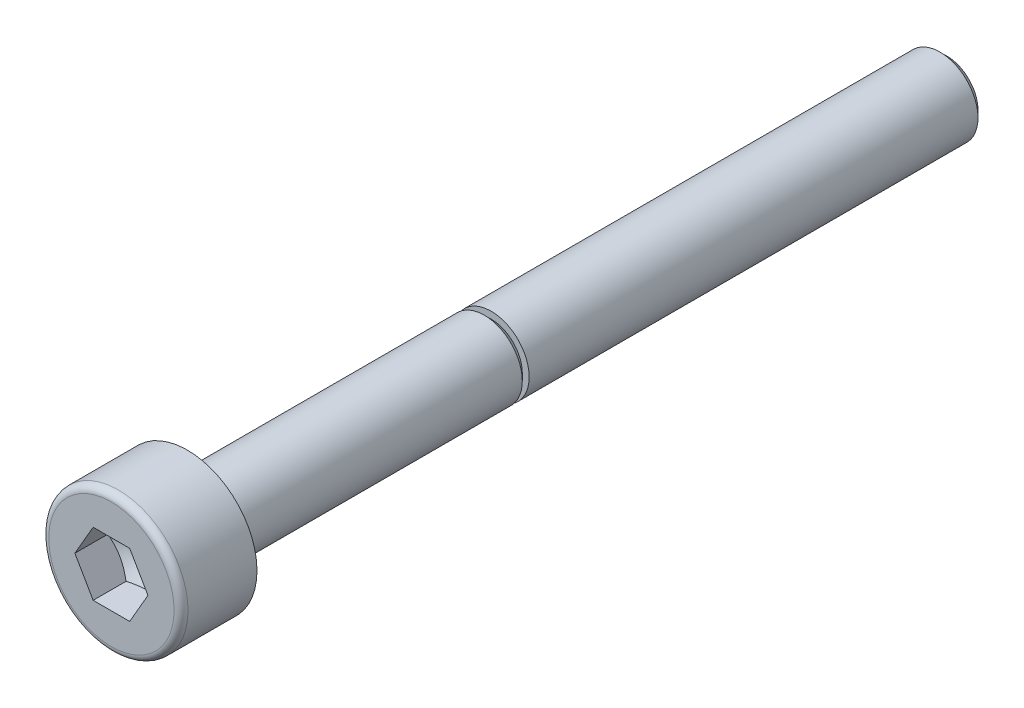
ISO-10303-21;
HEADER;
FILE_DESCRIPTION(('STEP AP214'),'2;1');
FILE_NAME('part.step','',(''),(''),'','','');
FILE_SCHEMA(('AUTOMOTIVE_DESIGN { 1 0 10303 214 1 1 1 1 }'));
ENDSEC;
DATA;
#1=APPLICATION_CONTEXT('core data for automotive mechanical design processes');
#2=APPLICATION_PROTOCOL_DEFINITION('international standard','automotive_design',2000,#1);
#3=PRODUCT_CONTEXT('',#1,'mechanical');
#4=PRODUCT('Part','Part','',(#3));
#5=PRODUCT_RELATED_PRODUCT_CATEGORY('part','',(#4));
#6=PRODUCT_DEFINITION_FORMATION('','',#4);
#7=PRODUCT_DEFINITION_CONTEXT('part definition',#1,'design');
#8=PRODUCT_DEFINITION('design','',#6,#7);
#9=PRODUCT_DEFINITION_SHAPE('','',#8);
#10=(LENGTH_UNIT() NAMED_UNIT(*) SI_UNIT(.MILLI.,.METRE.));
#11=(NAMED_UNIT(*) PLANE_ANGLE_UNIT() SI_UNIT($,.RADIAN.));
#12=(NAMED_UNIT(*) SI_UNIT($,.STERADIAN.) SOLID_ANGLE_UNIT());
#13=UNCERTAINTY_MEASURE_WITH_UNIT(LENGTH_MEASURE(1.E-05),#10,'distance_accuracy_value','');
#14=(GEOMETRIC_REPRESENTATION_CONTEXT(3) GLOBAL_UNCERTAINTY_ASSIGNED_CONTEXT((#13)) GLOBAL_UNIT_ASSIGNED_CONTEXT((#10,
#11,#12)) REPRESENTATION_CONTEXT('',''));
#15=CARTESIAN_POINT('',(0.,0.,0.));
#16=DIRECTION('',(0.,0.,1.));
#17=DIRECTION('',(1.,0.,0.));
#18=AXIS2_PLACEMENT_3D('',#15,#16,#17);
#19=CARTESIAN_POINT('',(0.,2.475,3.));
#20=DIRECTION('',(0.,0.,-1.));
#21=DIRECTION('',(-1.,0.,0.));
#22=AXIS2_PLACEMENT_3D('',#19,#20,#21);
#23=PLANE('',#22);
#24=CARTESIAN_POINT('',(0.,0.,3.));
#25=DIRECTION('',(0.,0.,1.));
#26=DIRECTION('',(1.,0.,0.));
#27=AXIS2_PLACEMENT_3D('',#24,#25,#26);
#28=CIRCLE('',#27,2.475);
#29=CARTESIAN_POINT('',(2.475,0.,3.));
#30=VERTEX_POINT('',#29);
#31=EDGE_CURVE('E136',#30,#30,#28,.T.);
#32=ORIENTED_EDGE('',*,*,#31,.T.);
#33=EDGE_LOOP('',(#32));
#34=FACE_BOUND('',#33,.T.);
#35=DIRECTION('',(0.5,-0.866025403784439,0.));
#36=VECTOR('',#35,1.);
#37=CARTESIAN_POINT('',(0.7216875,1.24999941718736,3.));
#38=LINE('',#37,#36);
#39=CARTESIAN_POINT('',(0.7216875,1.24999941718736,3.));
#40=VERTEX_POINT('',#39);
#41=CARTESIAN_POINT('',(1.443375,0.,3.));
#42=VERTEX_POINT('',#41);
#43=EDGE_CURVE('E30',#40,#42,#38,.T.);
#44=ORIENTED_EDGE('',*,*,#43,.T.);
#45=DIRECTION('',(-0.5,-0.866025403784439,0.));
#46=VECTOR('',#45,1.);
#47=CARTESIAN_POINT('',(1.443375,0.,3.));
#48=LINE('',#47,#46);
#49=CARTESIAN_POINT('',(0.7216875,-1.24999941718736,3.));
#50=VERTEX_POINT('',#49);
#51=EDGE_CURVE('E183',#42,#50,#48,.T.);
#52=ORIENTED_EDGE('',*,*,#51,.T.);
#53=DIRECTION('',(-1.,0.,0.));
#54=VECTOR('',#53,1.);
#55=CARTESIAN_POINT('',(0.7216875,-1.24999941718736,3.));
#56=LINE('',#55,#54);
#57=CARTESIAN_POINT('',(-0.7216875,-1.24999941718736,3.));
#58=VERTEX_POINT('',#57);
#59=EDGE_CURVE('E188',#50,#58,#56,.T.);
#60=ORIENTED_EDGE('',*,*,#59,.T.);
#61=DIRECTION('',(-0.5,0.866025403784439,0.));
#62=VECTOR('',#61,1.);
#63=CARTESIAN_POINT('',(-0.7216875,-1.24999941718736,3.));
#64=LINE('',#63,#62);
#65=CARTESIAN_POINT('',(-1.443375,0.,3.));
#66=VERTEX_POINT('',#65);
#67=EDGE_CURVE('E192',#58,#66,#64,.T.);
#68=ORIENTED_EDGE('',*,*,#67,.T.);
#69=DIRECTION('',(0.5,0.866025403784439,0.));
#70=VECTOR('',#69,1.);
#71=CARTESIAN_POINT('',(-1.443375,0.,3.));
#72=LINE('',#71,#70);
#73=CARTESIAN_POINT('',(-0.7216875,1.24999941718736,3.));
#74=VERTEX_POINT('',#73);
#75=EDGE_CURVE('E102',#66,#74,#72,.T.);
#76=ORIENTED_EDGE('',*,*,#75,.T.);
#77=DIRECTION('',(1.,0.,0.));
#78=VECTOR('',#77,1.);
#79=CARTESIAN_POINT('',(-0.7216875,1.24999941718736,3.));
#80=LINE('',#79,#78);
#81=EDGE_CURVE('E93',#74,#40,#80,.T.);
#82=ORIENTED_EDGE('',*,*,#81,.T.);
#83=EDGE_LOOP('',(#44,#52,#60,#68,#76,#82));
#84=FACE_BOUND('',#83,.T.);
#85=ADVANCED_FACE('F15',(#34,#84),#23,.F.);
#86=CARTESIAN_POINT('',(0.,0.,0.));
#87=DIRECTION('',(0.,0.,1.));
#88=DIRECTION('',(1.,0.,0.));
#89=AXIS2_PLACEMENT_3D('',#86,#87,#88);
#90=PLANE('',#89);
#91=CARTESIAN_POINT('',(0.,0.,0.));
#92=DIRECTION('',(0.,0.,1.));
#93=DIRECTION('',(1.,0.,0.));
#94=AXIS2_PLACEMENT_3D('',#91,#92,#93);
#95=CIRCLE('',#94,2.75);
#96=CARTESIAN_POINT('',(2.75,0.,0.));
#97=VERTEX_POINT('',#96);
#98=EDGE_CURVE('E23',#97,#97,#95,.T.);
#99=ORIENTED_EDGE('',*,*,#98,.F.);
#100=EDGE_LOOP('',(#99));
#101=FACE_BOUND('',#100,.T.);
#102=CARTESIAN_POINT('',(0.,0.,0.));
#103=DIRECTION('',(0.,0.,1.));
#104=DIRECTION('',(1.,0.,0.));
#105=AXIS2_PLACEMENT_3D('',#102,#103,#104);
#106=CIRCLE('',#105,1.5);
#107=CARTESIAN_POINT('',(1.5,0.,0.));
#108=VERTEX_POINT('',#107);
#109=EDGE_CURVE('E9',#108,#108,#106,.F.);
#110=ORIENTED_EDGE('',*,*,#109,.F.);
#111=EDGE_LOOP('',(#110));
#112=FACE_BOUND('',#111,.T.);
#113=ADVANCED_FACE('F151',(#101,#112),#90,.F.);
#114=CARTESIAN_POINT('',(0.,0.,3.));
#115=DIRECTION('',(0.,0.,1.));
#116=DIRECTION('',(1.,0.,0.));
#117=AXIS2_PLACEMENT_3D('',#114,#115,#116);
#118=CYLINDRICAL_SURFACE('',#117,2.75);
#119=CARTESIAN_POINT('',(0.,0.,2.725));
#120=DIRECTION('',(0.,0.,1.));
#121=DIRECTION('',(1.,0.,0.));
#122=AXIS2_PLACEMENT_3D('',#119,#120,#121);
#123=CIRCLE('',#122,2.75);
#124=CARTESIAN_POINT('',(2.75,0.,2.725));
#125=VERTEX_POINT('',#124);
#126=EDGE_CURVE('E140',#125,#125,#123,.T.);
#127=ORIENTED_EDGE('',*,*,#126,.F.);
#128=EDGE_LOOP('',(#127));
#129=FACE_BOUND('',#128,.T.);
#130=ORIENTED_EDGE('',*,*,#98,.T.);
#131=EDGE_LOOP('',(#130));
#132=FACE_BOUND('',#131,.T.);
#133=ADVANCED_FACE('F149',(#129,#132),#118,.T.);
#134=CARTESIAN_POINT('',(0.,0.,2.725));
#135=DIRECTION('',(0.,0.,1.));
#136=DIRECTION('',(1.,0.,0.));
#137=AXIS2_PLACEMENT_3D('',#134,#135,#136);
#138=TOROIDAL_SURFACE('',#137,2.475,0.275);
#139=ORIENTED_EDGE('',*,*,#31,.F.);
#140=EDGE_LOOP('',(#139));
#141=FACE_BOUND('',#140,.T.);
#142=ORIENTED_EDGE('',*,*,#126,.T.);
#143=EDGE_LOOP('',(#142));
#144=FACE_BOUND('',#143,.T.);
#145=ADVANCED_FACE('F159',(#141,#144),#138,.T.);
#146=CARTESIAN_POINT('',(0.,0.,0.));
#147=DIRECTION('',(0.,0.,1.));
#148=DIRECTION('',(1.,0.,0.));
#149=AXIS2_PLACEMENT_3D('',#146,#147,#148);
#150=CYLINDRICAL_SURFACE('',#149,1.5);
#151=CARTESIAN_POINT('',(0.,0.,-11.729375));
#152=DIRECTION('',(0.,0.,1.));
#153=DIRECTION('',(1.,0.,0.));
#154=AXIS2_PLACEMENT_3D('',#151,#152,#153);
#155=CIRCLE('',#154,1.5);
#156=CARTESIAN_POINT('',(1.5,0.,-11.729375));
#157=VERTEX_POINT('',#156);
#158=EDGE_CURVE('E116',#157,#157,#155,.T.);
#159=ORIENTED_EDGE('',*,*,#158,.T.);
#160=EDGE_LOOP('',(#159));
#161=FACE_BOUND('',#160,.T.);
#162=ORIENTED_EDGE('',*,*,#109,.T.);
#163=EDGE_LOOP('',(#162));
#164=FACE_BOUND('',#163,.T.);
#165=ADVANCED_FACE('F156',(#161,#164),#150,.T.);
#166=CARTESIAN_POINT('',(0.,0.,-30.));
#167=DIRECTION('',(0.,0.,1.));
#168=DIRECTION('',(1.,0.,0.));
#169=AXIS2_PLACEMENT_3D('',#166,#167,#168);
#170=PLANE('',#169);
#171=CARTESIAN_POINT('',(0.,0.,-30.));
#172=DIRECTION('',(0.,0.,1.));
#173=DIRECTION('',(1.,0.,0.));
#174=AXIS2_PLACEMENT_3D('',#171,#172,#173);
#175=CIRCLE('',#174,1.229375);
#176=CARTESIAN_POINT('',(1.229375,0.,-30.));
#177=VERTEX_POINT('',#176);
#178=EDGE_CURVE('E132',#177,#177,#175,.T.);
#179=ORIENTED_EDGE('',*,*,#178,.F.);
#180=EDGE_LOOP('',(#179));
#181=FACE_BOUND('',#180,.T.);
#182=ADVANCED_FACE('F158',(#181),#170,.F.);
#183=CARTESIAN_POINT('',(0.,0.,-30.));
#184=DIRECTION('',(0.,0.,1.));
#185=DIRECTION('',(1.,0.,0.));
#186=AXIS2_PLACEMENT_3D('',#183,#184,#185);
#187=CONICAL_SURFACE('',#186,1.229375,0.785398163397457);
#188=CARTESIAN_POINT('',(0.,0.,-29.729375));
#189=DIRECTION('',(0.,0.,1.));
#190=DIRECTION('',(1.,0.,0.));
#191=AXIS2_PLACEMENT_3D('',#188,#189,#190);
#192=CIRCLE('',#191,1.5);
#193=CARTESIAN_POINT('',(1.5,0.,-29.729375));
#194=VERTEX_POINT('',#193);
#195=EDGE_CURVE('E128',#194,#194,#192,.T.);
#196=ORIENTED_EDGE('',*,*,#195,.F.);
#197=EDGE_LOOP('',(#196));
#198=FACE_BOUND('',#197,.T.);
#199=ORIENTED_EDGE('',*,*,#178,.T.);
#200=EDGE_LOOP('',(#199));
#201=FACE_BOUND('',#200,.T.);
#202=ADVANCED_FACE('F167',(#198,#201),#187,.T.);
#203=CARTESIAN_POINT('',(0.,0.,0.));
#204=DIRECTION('',(0.,0.,1.));
#205=DIRECTION('',(1.,0.,0.));
#206=AXIS2_PLACEMENT_3D('',#203,#204,#205);
#207=CYLINDRICAL_SURFACE('',#206,1.5);
#208=CARTESIAN_POINT('',(0.,0.,-12.));
#209=DIRECTION('',(0.,0.,1.));
#210=DIRECTION('',(1.,0.,0.));
#211=AXIS2_PLACEMENT_3D('',#208,#209,#210);
#212=CIRCLE('',#211,1.5);
#213=CARTESIAN_POINT('',(1.5,0.,-12.));
#214=VERTEX_POINT('',#213);
#215=EDGE_CURVE('E124',#214,#214,#212,.T.);
#216=ORIENTED_EDGE('',*,*,#215,.F.);
#217=EDGE_LOOP('',(#216));
#218=FACE_BOUND('',#217,.T.);
#219=ORIENTED_EDGE('',*,*,#195,.T.);
#220=EDGE_LOOP('',(#219));
#221=FACE_BOUND('',#220,.T.);
#222=ADVANCED_FACE('F328',(#218,#221),#207,.T.);
#223=CARTESIAN_POINT('',(0.,1.5,-12.));
#224=DIRECTION('',(0.,0.,-1.));
#225=DIRECTION('',(-1.,0.,0.));
#226=AXIS2_PLACEMENT_3D('',#223,#224,#225);
#227=PLANE('',#226);
#228=CARTESIAN_POINT('',(0.,0.,-12.));
#229=DIRECTION('',(0.,0.,1.));
#230=DIRECTION('',(1.,0.,0.));
#231=AXIS2_PLACEMENT_3D('',#228,#229,#230);
#232=CIRCLE('',#231,1.229375);
#233=CARTESIAN_POINT('',(1.229375,0.,-12.));
#234=VERTEX_POINT('',#233);
#235=EDGE_CURVE('E120',#234,#234,#232,.T.);
#236=ORIENTED_EDGE('',*,*,#235,.F.);
#237=EDGE_LOOP('',(#236));
#238=FACE_BOUND('',#237,.T.);
#239=ORIENTED_EDGE('',*,*,#215,.T.);
#240=EDGE_LOOP('',(#239));
#241=FACE_BOUND('',#240,.T.);
#242=ADVANCED_FACE('F320',(#238,#241),#227,.F.);
#243=CARTESIAN_POINT('',(0.,0.,-12.));
#244=DIRECTION('',(0.,0.,1.));
#245=DIRECTION('',(1.,0.,0.));
#246=AXIS2_PLACEMENT_3D('',#243,#244,#245);
#247=CONICAL_SURFACE('',#246,1.229375,0.785398163397449);
#248=ORIENTED_EDGE('',*,*,#158,.F.);
#249=EDGE_LOOP('',(#248));
#250=FACE_BOUND('',#249,.T.);
#251=ORIENTED_EDGE('',*,*,#235,.T.);
#252=EDGE_LOOP('',(#251));
#253=FACE_BOUND('',#252,.T.);
#254=ADVANCED_FACE('F313',(#250,#253),#247,.T.);
#255=CARTESIAN_POINT('',(0.7216875,1.24999941718736,0.866667055208424));
#256=DIRECTION('',(-0.866025403784439,-0.5,0.));
#257=DIRECTION('',(-0.5,0.866025403784439,0.));
#258=AXIS2_PLACEMENT_3D('',#255,#256,#257);
#259=PLANE('',#258);
#260=DIRECTION('',(0.,0.,1.));
#261=VECTOR('',#260,1.);
#262=CARTESIAN_POINT('',(1.443375,0.,0.866667055208424));
#263=LINE('',#262,#261);
#264=CARTESIAN_POINT('',(1.443375,0.,1.7));
#265=VERTEX_POINT('',#264);
#266=EDGE_CURVE('E114',#265,#42,#263,.T.);
#267=ORIENTED_EDGE('',*,*,#266,.T.);
#268=ORIENTED_EDGE('',*,*,#43,.F.);
#269=DIRECTION('',(0.,0.,1.));
#270=VECTOR('',#269,1.);
#271=CARTESIAN_POINT('',(0.7216875,1.24999941718736,0.866667055208424));
#272=LINE('',#271,#270);
#273=CARTESIAN_POINT('',(0.7216875,1.24999941718736,1.7));
#274=VERTEX_POINT('',#273);
#275=EDGE_CURVE('E86',#274,#40,#272,.T.);
#276=ORIENTED_EDGE('',*,*,#275,.F.);
#277=CARTESIAN_POINT('',(1.44337615470054,-2.E-06,1.70000066666746));
#278=CARTESIAN_POINT('',(1.41166234028678,0.0549279378664336,1.68168533615401));
#279=CARTESIAN_POINT('',(1.37967477272109,0.110332030100754,1.665028493242));
#280=CARTESIAN_POINT('',(1.31514579266581,0.222099502117096,1.63595445502155));
#281=CARTESIAN_POINT('',(1.28260323398259,0.278464867164723,1.62354754391631));
#282=CARTESIAN_POINT('',(1.2179214008177,0.39049708853301,1.60423526604097));
#283=CARTESIAN_POINT('',(1.18579207575664,0.446146711951657,1.59720135081684));
#284=CARTESIAN_POINT('',(1.12138232312734,0.557707676008561,1.58880584887112));
#285=CARTESIAN_POINT('',(1.08910212951503,0.613618611423235,1.5874373083282));
#286=CARTESIAN_POINT('',(1.02878989848834,0.718082459879303,1.59029140151107));
#287=CARTESIAN_POINT('',(1.00074881136366,0.766651047478699,1.59381326069777));
#288=CARTESIAN_POINT('',(0.94484931590916,0.863471813723365,1.60497329524828));
#289=CARTESIAN_POINT('',(0.916991100780736,0.91172365773398,1.61261527923588));
#290=CARTESIAN_POINT('',(0.860976444321451,1.00874388868998,1.63171878575366));
#291=CARTESIAN_POINT('',(0.832827088932361,1.0575000024242,1.64326125012845));
#292=CARTESIAN_POINT('',(0.776948107685497,1.15428523701895,1.6694577743606));
#293=CARTESIAN_POINT('',(0.749217766489108,1.20231559688232,1.68410568290989));
#294=CARTESIAN_POINT('',(0.721686345299461,1.25000141718736,1.70000066666746));
#295=B_SPLINE_CURVE_WITH_KNOTS('',3,(#277,#278,#279,#280,#281,#282,#283,#284,#285,#286,#287,
#288,#289,#290,#291,#292,#293,#294),.UNSPECIFIED.,.F.,.F.,(4,2,2,2,2,2,2,2,4),(0.,
0.198135072963001,0.396746271230005,0.590442442133857,0.783900794935013,0.952318546997791,
1.12089225123217,1.29320414395206,1.46517785562982),.UNSPECIFIED.);
#296=EDGE_CURVE('E78',#265,#274,#295,.T.);
#297=ORIENTED_EDGE('',*,*,#296,.F.);
#298=EDGE_LOOP('',(#267,#268,#276,#297));
#299=FACE_BOUND('',#298,.T.);
#300=ADVANCED_FACE('F87',(#299),#259,.T.);
#301=CARTESIAN_POINT('',(1.443375,0.,0.866667055208424));
#302=DIRECTION('',(-0.866025403784439,0.5,0.));
#303=DIRECTION('',(0.5,0.866025403784439,0.));
#304=AXIS2_PLACEMENT_3D('',#301,#302,#303);
#305=PLANE('',#304);
#306=DIRECTION('',(0.,0.,1.));
#307=VECTOR('',#306,1.);
#308=CARTESIAN_POINT('',(0.7216875,-1.24999941718736,0.866667055208424));
#309=LINE('',#308,#307);
#310=CARTESIAN_POINT('',(0.7216875,-1.24999941718736,1.7));
#311=VERTEX_POINT('',#310);
#312=EDGE_CURVE('E111',#311,#50,#309,.T.);
#313=ORIENTED_EDGE('',*,*,#312,.T.);
#314=ORIENTED_EDGE('',*,*,#51,.F.);
#315=ORIENTED_EDGE('',*,*,#266,.F.);
#316=CARTESIAN_POINT('',(0.721686345299462,-1.25000141718736,1.70000066666746));
#317=CARTESIAN_POINT('',(0.753400159713217,-1.19507147932093,1.68168533615401));
#318=CARTESIAN_POINT('',(0.785387727278908,-1.13966738708661,1.665028493242));
#319=CARTESIAN_POINT('',(0.849916707334187,-1.02789991507027,1.63595445502155));
#320=CARTESIAN_POINT('',(0.882459266017406,-0.971534550022641,1.62354754391631));
#321=CARTESIAN_POINT('',(0.947141099182298,-0.859502328654354,1.60423526604097));
#322=CARTESIAN_POINT('',(0.979270424243356,-0.803852705235707,1.59720135081684));
#323=CARTESIAN_POINT('',(1.04368017687266,-0.692291741178803,1.58880584887112));
#324=CARTESIAN_POINT('',(1.07596037048497,-0.63638080576413,1.5874373083282));
#325=CARTESIAN_POINT('',(1.13627260151166,-0.531916957308062,1.59029140151107));
#326=CARTESIAN_POINT('',(1.16431368863634,-0.483348369708666,1.59381326069777));
#327=CARTESIAN_POINT('',(1.22021318409084,-0.386527603463999,1.60497329524828));
#328=CARTESIAN_POINT('',(1.24807139921926,-0.338275759453385,1.61261527923588));
#329=CARTESIAN_POINT('',(1.30408605567855,-0.241255528497386,1.63171878575366));
#330=CARTESIAN_POINT('',(1.33223541106764,-0.192499414763169,1.64326125012845));
#331=CARTESIAN_POINT('',(1.3881143923145,-0.0957141801684128,1.6694577743606));
#332=CARTESIAN_POINT('',(1.41584473351089,-0.0476838203050465,1.68410568290989));
#333=CARTESIAN_POINT('',(1.44337615470054,1.99999999983435E-06,1.70000066666746));
#334=B_SPLINE_CURVE_WITH_KNOTS('',3,(#316,#317,#318,#319,#320,#321,#322,#323,#324,#325,#326,
#327,#328,#329,#330,#331,#332,#333),.UNSPECIFIED.,.F.,.F.,(4,2,2,2,2,2,2,2,4),(0.,
0.198135072963001,0.396746271230005,0.590442442133857,0.783900794935012,0.95231854699779,
1.12089225123217,1.29320414395206,1.46517785562982),.UNSPECIFIED.);
#335=EDGE_CURVE('E82',#311,#265,#334,.T.);
#336=ORIENTED_EDGE('',*,*,#335,.F.);
#337=EDGE_LOOP('',(#313,#314,#315,#336));
#338=FACE_BOUND('',#337,.T.);
#339=ADVANCED_FACE('F248',(#338),#305,.T.);
#340=CARTESIAN_POINT('',(0.7216875,-1.24999941718736,0.866667055208424));
#341=DIRECTION('',(0.,1.,0.));
#342=DIRECTION('',(1.,0.,0.));
#343=AXIS2_PLACEMENT_3D('',#340,#341,#342);
#344=PLANE('',#343);
#345=DIRECTION('',(0.,0.,1.));
#346=VECTOR('',#345,1.);
#347=CARTESIAN_POINT('',(-0.7216875,-1.24999941718736,0.866667055208424));
#348=LINE('',#347,#346);
#349=CARTESIAN_POINT('',(-0.7216875,-1.24999941718736,1.7));
#350=VERTEX_POINT('',#349);
#351=EDGE_CURVE('E108',#350,#58,#348,.T.);
#352=ORIENTED_EDGE('',*,*,#351,.T.);
#353=ORIENTED_EDGE('',*,*,#59,.F.);
#354=ORIENTED_EDGE('',*,*,#312,.F.);
#355=CARTESIAN_POINT('',(-1.86893053107489,-1.24999941718736,2.16479389453662));
#356=CARTESIAN_POINT('',(-1.81495117776836,-1.24999941718736,2.13889663446086));
#357=CARTESIAN_POINT('',(-1.76084043441986,-1.24999941718736,2.11326843017583));
#358=CARTESIAN_POINT('',(-1.65228585942289,-1.24999941718736,2.06270259301794));
#359=CARTESIAN_POINT('',(-1.59784196995446,-1.24999941718736,2.03776508442438));
#360=CARTESIAN_POINT('',(-1.48823862830604,-1.24999941718736,1.98859378412848));
#361=CARTESIAN_POINT('',(-1.43307683885742,-1.24999941718736,1.964365178818));
#362=CARTESIAN_POINT('',(-1.32229127521218,-1.24999941718736,1.91699497239768));
#363=CARTESIAN_POINT('',(-1.26666752521415,-1.24999941718736,1.89385331476833));
#364=CARTESIAN_POINT('',(-1.15340030068293,-1.24999941718736,1.84835454701775));
#365=CARTESIAN_POINT('',(-1.09574203904477,-1.24999941718736,1.82603375946839));
#366=CARTESIAN_POINT('',(-0.979740631963517,-1.24999941718736,1.7832554401815));
#367=CARTESIAN_POINT('',(-0.921397401730977,-1.24999941718736,1.76279814192238));
#368=CARTESIAN_POINT('',(-0.745435180245369,-1.24999941718736,1.7050842361654));
#369=CARTESIAN_POINT('',(-0.626561647576072,-1.24999941718736,1.6713502286798));
#370=CARTESIAN_POINT('',(-0.445872875814715,-1.24999941718736,1.63222043843359));
#371=CARTESIAN_POINT('',(-0.385304520505474,-1.24999941718736,1.62109409740059));
#372=CARTESIAN_POINT('',(-0.263486469039549,-1.24999941718736,1.60342789727153));
#373=CARTESIAN_POINT('',(-0.20223681921018,-1.24999941718736,1.59688772823406));
#374=CARTESIAN_POINT('',(-0.0801324091719259,-1.24999941718736,1.58899883278388));
#375=CARTESIAN_POINT('',(-0.0192817104364654,-1.24999941718736,1.58758884366631));
#376=CARTESIAN_POINT('',(0.102319185361569,-1.24999941718736,1.58991623923036));
#377=CARTESIAN_POINT('',(0.163069375967905,-1.24999941718736,1.59365394263641));
#378=CARTESIAN_POINT('',(0.312961455362286,-1.24999941718736,1.60889807076613));
#379=CARTESIAN_POINT('',(0.40181287263432,-1.24999941718736,1.62326128492051));
#380=CARTESIAN_POINT('',(0.577787885436386,-1.24999941718736,1.66029986996745));
#381=CARTESIAN_POINT('',(0.664909264565296,-1.24999941718736,1.6829852590032));
#382=CARTESIAN_POINT('',(0.795208864990653,-1.24999941718736,1.72173744658089));
#383=CARTESIAN_POINT('',(0.839060620655932,-1.24999941718736,1.73562293145017));
#384=CARTESIAN_POINT('',(0.926307663712636,-1.24999941718736,1.76467838801274));
#385=CARTESIAN_POINT('',(0.969703217226752,-1.24999941718736,1.77984755808705));
#386=CARTESIAN_POINT('',(1.05609584795378,-1.24999941718736,1.81125008410185));
#387=CARTESIAN_POINT('',(1.09909299597128,-1.24999941718736,1.82748324664252));
#388=CARTESIAN_POINT('',(1.18474848915208,-1.24999941718736,1.86083816989018));
#389=CARTESIAN_POINT('',(1.22740677566046,-1.24999941718736,1.87796008072948));
#390=CARTESIAN_POINT('',(1.33629337906013,-1.24999941718736,1.92276108125511));
#391=CARTESIAN_POINT('',(1.40230397627437,-1.24999941718736,1.95096876212353));
#392=CARTESIAN_POINT('',(1.53372907463052,-1.24999941718736,2.00874389121968));
#393=CARTESIAN_POINT('',(1.59914353067598,-1.24999941718736,2.03831144131143));
#394=CARTESIAN_POINT('',(1.79469131828896,-1.24999941718736,2.12857452862346));
#395=CARTESIAN_POINT('',(1.92410722703437,-1.24999941718736,2.19082124932175));
#396=CARTESIAN_POINT('',(2.18183340208154,-1.24999941718736,2.31792530727724));
#397=CARTESIAN_POINT('',(2.31014211360569,-1.24999941718736,2.3827857597699));
#398=CARTESIAN_POINT('',(2.565880437641,-1.24999941718736,2.51417443954414));
#399=CARTESIAN_POINT('',(2.69331015929244,-1.24999941718736,2.58070245483918));
#400=CARTESIAN_POINT('',(2.93556233058972,-1.24999941718736,2.70857379582091));
#401=CARTESIAN_POINT('',(3.05043950275986,-1.24999941718736,2.76981380943349));
#402=CARTESIAN_POINT('',(3.27982431975772,-1.24999941718736,2.89299160700423));
#403=CARTESIAN_POINT('',(3.39433195070739,-1.24999941718736,2.95492941678458));
#404=CARTESIAN_POINT('',(3.62277162051502,-1.24999941718736,3.07916961449806));
#405=CARTESIAN_POINT('',(3.73670438259663,-1.24999941718736,3.14147067442078));
#406=CARTESIAN_POINT('',(3.96433956104116,-1.24999941718736,3.26647828608533));
#407=CARTESIAN_POINT('',(4.07804198914647,-1.24999941718736,3.32918481643642));
#408=CARTESIAN_POINT('',(4.19166166337244,-1.24999941718736,3.39204003381013));
#409=B_SPLINE_CURVE_WITH_KNOTS('',3,(#355,#356,#357,#358,#359,#360,#361,#362,#363,#364,#365,
#366,#367,#368,#369,#370,#371,#372,#373,#374,#375,#376,#377,#378,#379,#380,#381,#382,#383,#384,
#385,#386,#387,#388,#389,#390,#391,#392,#393,#394,#395,#396,#397,#398,#399,#400,#401,#402,#403,
#404,#405,#406,#407,#408),.UNSPECIFIED.,.F.,.F.,(4,2,2,2,2,2,2,2,2,2,2,2,2,2,2,2,2,2,2,2,2,2,2,
2,2,2,4),(0.,0.179612840817485,0.359257792773138,0.539992477393523,0.72071775367729,
0.906167353114828,1.09164015584897,1.46153946542598,1.64614477745769,1.83073761234132,
2.01311873652213,2.1955111535168,2.46497183475509,2.73475795996105,2.87273569413166,
3.01062789275234,3.14849509611698,3.28638566505407,3.50171816734966,3.71706682595868,
4.14783526963883,4.57913326931211,5.01037671616215,5.40091711572386,5.79147201515411,
6.18103353481212,6.57057466801426),.UNSPECIFIED.);
#410=EDGE_CURVE('E236',#350,#311,#409,.T.);
#411=ORIENTED_EDGE('',*,*,#410,.F.);
#412=EDGE_LOOP('',(#352,#353,#354,#411));
#413=FACE_BOUND('',#412,.T.);
#414=ADVANCED_FACE('F243',(#413),#344,.T.);
#415=CARTESIAN_POINT('',(-0.7216875,-1.24999941718736,0.866667055208424));
#416=DIRECTION('',(0.866025403784439,0.5,0.));
#417=DIRECTION('',(0.5,-0.866025403784439,0.));
#418=AXIS2_PLACEMENT_3D('',#415,#416,#417);
#419=PLANE('',#418);
#420=DIRECTION('',(0.,0.,1.));
#421=VECTOR('',#420,1.);
#422=CARTESIAN_POINT('',(-1.443375,0.,0.866667055208424));
#423=LINE('',#422,#421);
#424=CARTESIAN_POINT('',(-1.443375,0.,1.7));
#425=VERTEX_POINT('',#424);
#426=EDGE_CURVE('E99',#425,#66,#423,.T.);
#427=ORIENTED_EDGE('',*,*,#426,.T.);
#428=ORIENTED_EDGE('',*,*,#67,.F.);
#429=ORIENTED_EDGE('',*,*,#351,.F.);
#430=CARTESIAN_POINT('',(-1.44337615470054,2.00000000041633E-06,1.70000066666746));
#431=CARTESIAN_POINT('',(-1.41166234028678,-0.0549279378664328,1.68168533615401));
#432=CARTESIAN_POINT('',(-1.37967477272109,-0.110332030100753,1.665028493242));
#433=CARTESIAN_POINT('',(-1.31514579266581,-0.222099502117095,1.63595445502155));
#434=CARTESIAN_POINT('',(-1.28260323398259,-0.278464867164722,1.62354754391631));
#435=CARTESIAN_POINT('',(-1.2179214008177,-0.390497088533009,1.60423526604097));
#436=CARTESIAN_POINT('',(-1.18579207575664,-0.446146711951656,1.59720135081684));
#437=CARTESIAN_POINT('',(-1.12138232312734,-0.55770767600856,1.58880584887112));
#438=CARTESIAN_POINT('',(-1.08910212951503,-0.613618611423234,1.5874373083282));
#439=CARTESIAN_POINT('',(-1.02878989848834,-0.718082459879302,1.59029140151107));
#440=CARTESIAN_POINT('',(-1.00074881136366,-0.766651047478698,1.59381326069777));
#441=CARTESIAN_POINT('',(-0.944849315909161,-0.863471813723365,1.60497329524827));
#442=CARTESIAN_POINT('',(-0.916991100780737,-0.911723657733979,1.61261527923588));
#443=CARTESIAN_POINT('',(-0.860976444321451,-1.00874388868998,1.63171878575366));
#444=CARTESIAN_POINT('',(-0.832827088932361,-1.0575000024242,1.64326125012845));
#445=CARTESIAN_POINT('',(-0.776948107685497,-1.15428523701895,1.6694577743606));
#446=CARTESIAN_POINT('',(-0.749217766489108,-1.20231559688232,1.68410568290989));
#447=CARTESIAN_POINT('',(-0.721686345299461,-1.25000141718736,1.70000066666746));
#448=B_SPLINE_CURVE_WITH_KNOTS('',3,(#430,#431,#432,#433,#434,#435,#436,#437,#438,#439,#440,
#441,#442,#443,#444,#445,#446,#447),.UNSPECIFIED.,.F.,.F.,(4,2,2,2,2,2,2,2,4),(0.,
0.198135072963001,0.396746271230005,0.590442442133858,0.783900794935013,0.952318546997791,
1.12089225123217,1.29320414395206,1.46517785562982),.UNSPECIFIED.);
#449=EDGE_CURVE('E229',#425,#350,#448,.T.);
#450=ORIENTED_EDGE('',*,*,#449,.F.);
#451=EDGE_LOOP('',(#427,#428,#429,#450));
#452=FACE_BOUND('',#451,.T.);
#453=ADVANCED_FACE('F212',(#452),#419,.T.);
#454=CARTESIAN_POINT('',(-1.443375,0.,0.866667055208424));
#455=DIRECTION('',(0.866025403784439,-0.5,0.));
#456=DIRECTION('',(-0.5,-0.866025403784439,0.));
#457=AXIS2_PLACEMENT_3D('',#454,#455,#456);
#458=PLANE('',#457);
#459=DIRECTION('',(0.,0.,1.));
#460=VECTOR('',#459,1.);
#461=CARTESIAN_POINT('',(-0.7216875,1.24999941718736,0.866667055208424));
#462=LINE('',#461,#460);
#463=CARTESIAN_POINT('',(-0.7216875,1.24999941718736,1.7));
#464=VERTEX_POINT('',#463);
#465=EDGE_CURVE('E92',#464,#74,#462,.T.);
#466=ORIENTED_EDGE('',*,*,#465,.T.);
#467=ORIENTED_EDGE('',*,*,#75,.F.);
#468=ORIENTED_EDGE('',*,*,#426,.F.);
#469=CARTESIAN_POINT('',(-0.721686345299462,1.25000141718736,1.70000066666746));
#470=CARTESIAN_POINT('',(-0.753400159713217,1.19507147932093,1.68168533615401));
#471=CARTESIAN_POINT('',(-0.785387727278908,1.13966738708661,1.665028493242));
#472=CARTESIAN_POINT('',(-0.849916707334187,1.02789991507027,1.63595445502155));
#473=CARTESIAN_POINT('',(-0.882459266017407,0.971534550022641,1.62354754391631));
#474=CARTESIAN_POINT('',(-0.947141099182298,0.859502328654354,1.60423526604097));
#475=CARTESIAN_POINT('',(-0.979270424243356,0.803852705235707,1.59720135081684));
#476=CARTESIAN_POINT('',(-1.04368017687266,0.692291741178803,1.58880584887112));
#477=CARTESIAN_POINT('',(-1.07596037048497,0.636380805764129,1.5874373083282));
#478=CARTESIAN_POINT('',(-1.13627260151166,0.531916957308061,1.59029140151107));
#479=CARTESIAN_POINT('',(-1.16431368863634,0.483348369708665,1.59381326069777));
#480=CARTESIAN_POINT('',(-1.22021318409084,0.386527603463999,1.60497329524828));
#481=CARTESIAN_POINT('',(-1.24807139921926,0.338275759453385,1.61261527923588));
#482=CARTESIAN_POINT('',(-1.30408605567855,0.241255528497386,1.63171878575366));
#483=CARTESIAN_POINT('',(-1.33223541106764,0.192499414763169,1.64326125012845));
#484=CARTESIAN_POINT('',(-1.3881143923145,0.0957141801684129,1.6694577743606));
#485=CARTESIAN_POINT('',(-1.41584473351089,0.0476838203050468,1.68410568290989));
#486=CARTESIAN_POINT('',(-1.44337615470054,-1.99999999947233E-06,1.70000066666746));
#487=B_SPLINE_CURVE_WITH_KNOTS('',3,(#469,#470,#471,#472,#473,#474,#475,#476,#477,#478,#479,
#480,#481,#482,#483,#484,#485,#486),.UNSPECIFIED.,.F.,.F.,(4,2,2,2,2,2,2,2,4),(0.,
0.198135072963001,0.396746271230005,0.590442442133857,0.783900794935013,0.95231854699779,
1.12089225123217,1.29320414395206,1.46517785562982),.UNSPECIFIED.);
#488=EDGE_CURVE('E38',#464,#425,#487,.T.);
#489=ORIENTED_EDGE('',*,*,#488,.F.);
#490=EDGE_LOOP('',(#466,#467,#468,#489));
#491=FACE_BOUND('',#490,.T.);
#492=ADVANCED_FACE('F206',(#491),#458,.T.);
#493=CARTESIAN_POINT('',(-0.7216875,1.24999941718736,0.866667055208424));
#494=DIRECTION('',(0.,-1.,0.));
#495=DIRECTION('',(-1.,0.,0.));
#496=AXIS2_PLACEMENT_3D('',#493,#494,#495);
#497=PLANE('',#496);
#498=ORIENTED_EDGE('',*,*,#275,.T.);
#499=ORIENTED_EDGE('',*,*,#81,.F.);
#500=ORIENTED_EDGE('',*,*,#465,.F.);
#501=CARTESIAN_POINT('',(-1.86893053107489,1.24999941718736,2.16479389453662));
#502=CARTESIAN_POINT('',(-1.81495117776836,1.24999941718736,2.13889663446086));
#503=CARTESIAN_POINT('',(-1.76084043441986,1.24999941718736,2.11326843017583));
#504=CARTESIAN_POINT('',(-1.65228585942289,1.24999941718736,2.06270259301794));
#505=CARTESIAN_POINT('',(-1.59784196995446,1.24999941718736,2.03776508442438));
#506=CARTESIAN_POINT('',(-1.48823862830604,1.24999941718736,1.98859378412848));
#507=CARTESIAN_POINT('',(-1.43307683885742,1.24999941718736,1.964365178818));
#508=CARTESIAN_POINT('',(-1.32229127521218,1.24999941718736,1.91699497239768));
#509=CARTESIAN_POINT('',(-1.26666752521415,1.24999941718736,1.89385331476833));
#510=CARTESIAN_POINT('',(-1.15340030068293,1.24999941718736,1.84835454701775));
#511=CARTESIAN_POINT('',(-1.09574203904477,1.24999941718736,1.82603375946839));
#512=CARTESIAN_POINT('',(-0.979740631963517,1.24999941718736,1.7832554401815));
#513=CARTESIAN_POINT('',(-0.921397401730978,1.24999941718736,1.76279814192238));
#514=CARTESIAN_POINT('',(-0.745435180245369,1.24999941718736,1.7050842361654));
#515=CARTESIAN_POINT('',(-0.626561647576072,1.24999941718736,1.6713502286798));
#516=CARTESIAN_POINT('',(-0.445872875814715,1.24999941718736,1.63222043843359));
#517=CARTESIAN_POINT('',(-0.385304520505474,1.24999941718736,1.62109409740059));
#518=CARTESIAN_POINT('',(-0.263486469039549,1.24999941718736,1.60342789727153));
#519=CARTESIAN_POINT('',(-0.20223681921018,1.24999941718736,1.59688772823406));
#520=CARTESIAN_POINT('',(-0.0801324091719265,1.24999941718736,1.58899883278388));
#521=CARTESIAN_POINT('',(-0.0192817104364659,1.24999941718736,1.58758884366631));
#522=CARTESIAN_POINT('',(0.102319185361568,1.24999941718736,1.58991623923036));
#523=CARTESIAN_POINT('',(0.163069375967905,1.24999941718736,1.59365394263641));
#524=CARTESIAN_POINT('',(0.312961455362285,1.24999941718736,1.60889807076613));
#525=CARTESIAN_POINT('',(0.401812872634319,1.24999941718736,1.62326128492051));
#526=CARTESIAN_POINT('',(0.577787885436385,1.24999941718736,1.66029986996745));
#527=CARTESIAN_POINT('',(0.664909264565295,1.24999941718736,1.6829852590032));
#528=CARTESIAN_POINT('',(0.795208864990651,1.24999941718736,1.72173744658089));
#529=CARTESIAN_POINT('',(0.839060620655931,1.24999941718736,1.73562293145017));
#530=CARTESIAN_POINT('',(0.926307663712634,1.24999941718736,1.76467838801274));
#531=CARTESIAN_POINT('',(0.969703217226751,1.24999941718736,1.77984755808705));
#532=CARTESIAN_POINT('',(1.05609584795378,1.24999941718737,1.81125008410185));
#533=CARTESIAN_POINT('',(1.09909299597128,1.24999941718737,1.82748324664252));
#534=CARTESIAN_POINT('',(1.18474848915208,1.24999941718736,1.86083816989018));
#535=CARTESIAN_POINT('',(1.22740677566045,1.24999941718736,1.87796008072948));
#536=CARTESIAN_POINT('',(1.33629337906013,1.24999941718736,1.92276108125511));
#537=CARTESIAN_POINT('',(1.40230397627436,1.24999941718736,1.95096876212353));
#538=CARTESIAN_POINT('',(1.53372907463051,1.24999941718737,2.00874389121968));
#539=CARTESIAN_POINT('',(1.59914353067597,1.24999941718737,2.03831144131143));
#540=CARTESIAN_POINT('',(1.79469131828895,1.24999941718736,2.12857452862346));
#541=CARTESIAN_POINT('',(1.92410722703437,1.24999941718737,2.19082124932175));
#542=CARTESIAN_POINT('',(2.18183340208154,1.24999941718737,2.31792530727724));
#543=CARTESIAN_POINT('',(2.31014211360569,1.24999941718737,2.3827857597699));
#544=CARTESIAN_POINT('',(2.565880437641,1.24999941718737,2.51417443954414));
#545=CARTESIAN_POINT('',(2.69331015929244,1.24999941718737,2.58070245483918));
#546=CARTESIAN_POINT('',(2.93556233058972,1.24999941718737,2.70857379582091));
#547=CARTESIAN_POINT('',(3.05043950275985,1.24999941718737,2.76981380943349));
#548=CARTESIAN_POINT('',(3.27982431975771,1.24999941718737,2.89299160700422));
#549=CARTESIAN_POINT('',(3.39433195070738,1.24999941718737,2.95492941678457));
#550=CARTESIAN_POINT('',(3.62277162051502,1.24999941718737,3.07916961449806));
#551=CARTESIAN_POINT('',(3.73670438259662,1.24999941718737,3.14147067442078));
#552=CARTESIAN_POINT('',(3.96433956104115,1.24999941718737,3.26647828608533));
#553=CARTESIAN_POINT('',(4.07804198914646,1.24999941718737,3.32918481643642));
#554=CARTESIAN_POINT('',(4.19166166337243,1.24999941718737,3.39204003381013));
#555=B_SPLINE_CURVE_WITH_KNOTS('',3,(#501,#502,#503,#504,#505,#506,#507,#508,#509,#510,#511,
#512,#513,#514,#515,#516,#517,#518,#519,#520,#521,#522,#523,#524,#525,#526,#527,#528,#529,#530,
#531,#532,#533,#534,#535,#536,#537,#538,#539,#540,#541,#542,#543,#544,#545,#546,#547,#548,#549,
#550,#551,#552,#553,#554),.UNSPECIFIED.,.F.,.F.,(4,2,2,2,2,2,2,2,2,2,2,2,2,2,2,2,2,2,2,2,2,2,2,
2,2,2,4),(0.,0.179612840817484,0.359257792773138,0.539992477393523,0.72071775367729,
0.906167353114828,1.09164015584897,1.46153946542598,1.64614477745769,1.83073761234132,
2.01311873652213,2.1955111535168,2.46497183475509,2.73475795996105,2.87273569413165,
3.01062789275234,3.14849509611698,3.28638566505407,3.50171816734966,3.71706682595868,
4.14783526963883,4.5791332693121,5.01037671616214,5.40091711572385,5.7914720151541,
6.18103353481212,6.57057466801426),.UNSPECIFIED.);
#556=EDGE_CURVE('E79',#274,#464,#555,.F.);
#557=ORIENTED_EDGE('',*,*,#556,.F.);
#558=EDGE_LOOP('',(#498,#499,#500,#557));
#559=FACE_BOUND('',#558,.T.);
#560=ADVANCED_FACE('F74',(#559),#497,.T.);
#561=CARTESIAN_POINT('',(0.,0.,0.866667055208424));
#562=DIRECTION('',(0.,0.,1.));
#563=DIRECTION('',(1.,0.,0.));
#564=AXIS2_PLACEMENT_3D('',#561,#562,#563);
#565=CONICAL_SURFACE('',#564,0.,1.0471975511966);
#566=CARTESIAN_POINT('',(0.,0.,0.866667055208424));
#567=VERTEX_POINT('',#566);
#568=VERTEX_LOOP('',#567);
#569=FACE_BOUND('',#568,.T.);
#570=ORIENTED_EDGE('',*,*,#296,.T.);
#571=ORIENTED_EDGE('',*,*,#556,.T.);
#572=ORIENTED_EDGE('',*,*,#488,.T.);
#573=ORIENTED_EDGE('',*,*,#449,.T.);
#574=ORIENTED_EDGE('',*,*,#410,.T.);
#575=ORIENTED_EDGE('',*,*,#335,.T.);
#576=EDGE_LOOP('',(#570,#571,#572,#573,#574,#575));
#577=FACE_BOUND('',#576,.T.);
#578=ADVANCED_FACE('F71',(#569,#577),#565,.F.);
#579=CLOSED_SHELL('',(#85,#113,#133,#145,#165,#182,#202,#222,#242,#254,#300,#339,#414,#453,#492,
#560,#578));
#580=MANIFOLD_SOLID_BREP('B1',#579);
#581=ADVANCED_BREP_SHAPE_REPRESENTATION('',(#18,#580),#14);
#582=SHAPE_DEFINITION_REPRESENTATION(#9,#581);
ENDSEC;
END-ISO-10303-21;
